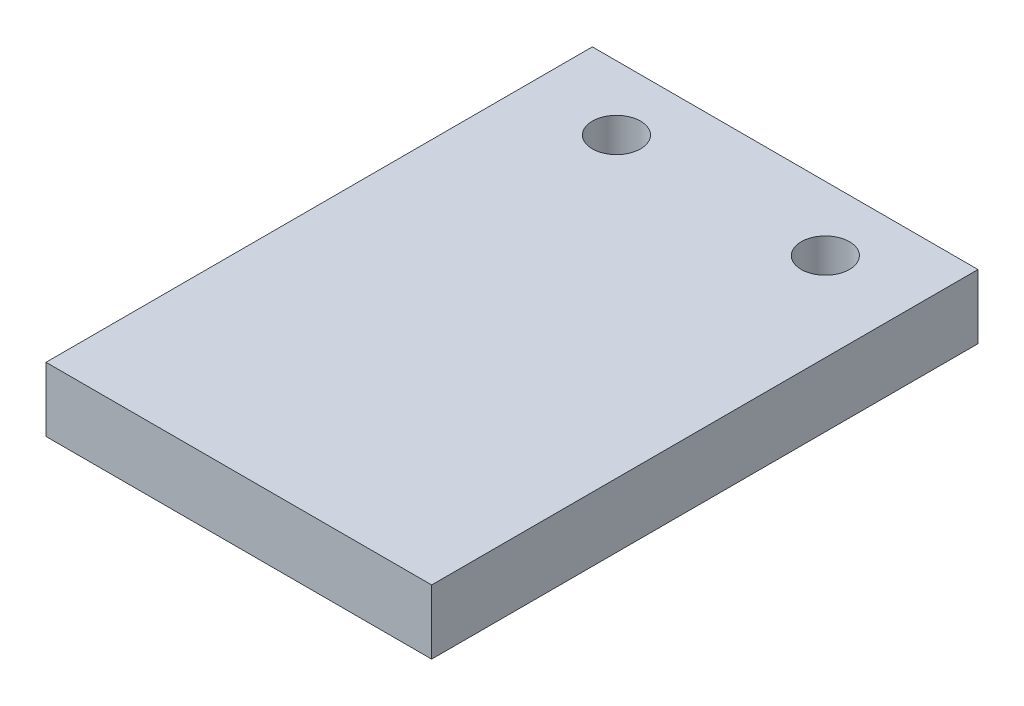
ISO-10303-21;
HEADER;
FILE_DESCRIPTION(('STEP AP214'),'2;1');
FILE_NAME('part.step','',(''),(''),'','','');
FILE_SCHEMA(('AUTOMOTIVE_DESIGN { 1 0 10303 214 1 1 1 1 }'));
ENDSEC;
DATA;
#1=APPLICATION_CONTEXT('core data for automotive mechanical design processes');
#2=APPLICATION_PROTOCOL_DEFINITION('international standard','automotive_design',2000,#1);
#3=PRODUCT_CONTEXT('',#1,'mechanical');
#4=PRODUCT('Part','Part','',(#3));
#5=PRODUCT_RELATED_PRODUCT_CATEGORY('part','',(#4));
#6=PRODUCT_DEFINITION_FORMATION('','',#4);
#7=PRODUCT_DEFINITION_CONTEXT('part definition',#1,'design');
#8=PRODUCT_DEFINITION('design','',#6,#7);
#9=PRODUCT_DEFINITION_SHAPE('','',#8);
#10=(LENGTH_UNIT() NAMED_UNIT(*) SI_UNIT(.MILLI.,.METRE.));
#11=(NAMED_UNIT(*) PLANE_ANGLE_UNIT() SI_UNIT($,.RADIAN.));
#12=(NAMED_UNIT(*) SI_UNIT($,.STERADIAN.) SOLID_ANGLE_UNIT());
#13=UNCERTAINTY_MEASURE_WITH_UNIT(LENGTH_MEASURE(1.E-05),#10,'distance_accuracy_value','');
#14=(GEOMETRIC_REPRESENTATION_CONTEXT(3) GLOBAL_UNCERTAINTY_ASSIGNED_CONTEXT((#13)) GLOBAL_UNIT_ASSIGNED_CONTEXT((#10,
#11,#12)) REPRESENTATION_CONTEXT('',''));
#15=CARTESIAN_POINT('',(0.,0.,0.));
#16=DIRECTION('',(0.,0.,1.));
#17=DIRECTION('',(1.,0.,0.));
#18=AXIS2_PLACEMENT_3D('',#15,#16,#17);
#19=CARTESIAN_POINT('',(-17.4625,12.7,-12.7));
#20=DIRECTION('',(0.,-1.,0.));
#21=DIRECTION('',(0.,0.,-1.));
#22=AXIS2_PLACEMENT_3D('',#19,#20,#21);
#23=PLANE('',#22);
#24=CARTESIAN_POINT('',(0.,12.7,0.));
#25=DIRECTION('',(0.,1.,0.));
#26=DIRECTION('',(0.,0.,1.));
#27=AXIS2_PLACEMENT_3D('',#24,#25,#26);
#28=CIRCLE('',#27,4.7625);
#29=CARTESIAN_POINT('',(0.,12.7,4.7625));
#30=VERTEX_POINT('',#29);
#31=EDGE_CURVE('E98',#30,#30,#28,.T.);
#32=ORIENTED_EDGE('',*,*,#31,.F.);
#33=EDGE_LOOP('',(#32));
#34=FACE_BOUND('',#33,.T.);
#35=DIRECTION('',(0.,0.,1.));
#36=VECTOR('',#35,1.);
#37=CARTESIAN_POINT('',(-17.4625,12.7,95.25));
#38=LINE('',#37,#36);
#39=CARTESIAN_POINT('',(-17.4625,12.7,-12.7));
#40=VERTEX_POINT('',#39);
#41=CARTESIAN_POINT('',(-17.4625,12.7,95.25));
#42=VERTEX_POINT('',#41);
#43=EDGE_CURVE('E83',#40,#42,#38,.T.);
#44=ORIENTED_EDGE('',*,*,#43,.T.);
#45=DIRECTION('',(1.,0.,0.));
#46=VECTOR('',#45,1.);
#47=CARTESIAN_POINT('',(58.7375,12.7,95.25));
#48=LINE('',#47,#46);
#49=CARTESIAN_POINT('',(58.7375,12.7,95.25));
#50=VERTEX_POINT('',#49);
#51=EDGE_CURVE('E78',#42,#50,#48,.T.);
#52=ORIENTED_EDGE('',*,*,#51,.T.);
#53=DIRECTION('',(0.,0.,-1.));
#54=VECTOR('',#53,1.);
#55=CARTESIAN_POINT('',(58.7375,12.7,-12.7));
#56=LINE('',#55,#54);
#57=CARTESIAN_POINT('',(58.7375,12.7,-12.7));
#58=VERTEX_POINT('',#57);
#59=EDGE_CURVE('E81',#50,#58,#56,.T.);
#60=ORIENTED_EDGE('',*,*,#59,.T.);
#61=DIRECTION('',(-1.,0.,0.));
#62=VECTOR('',#61,1.);
#63=CARTESIAN_POINT('',(-17.4625,12.7,-12.7));
#64=LINE('',#63,#62);
#65=EDGE_CURVE('E48',#58,#40,#64,.T.);
#66=ORIENTED_EDGE('',*,*,#65,.T.);
#67=EDGE_LOOP('',(#44,#52,#60,#66));
#68=FACE_BOUND('',#67,.T.);
#69=CARTESIAN_POINT('',(41.275,12.7,0.));
#70=DIRECTION('',(0.,1.,0.));
#71=DIRECTION('',(0.,0.,1.));
#72=AXIS2_PLACEMENT_3D('',#69,#70,#71);
#73=CIRCLE('',#72,4.7625);
#74=CARTESIAN_POINT('',(41.275,12.7,4.7625));
#75=VERTEX_POINT('',#74);
#76=EDGE_CURVE('E113',#75,#75,#73,.T.);
#77=ORIENTED_EDGE('',*,*,#76,.F.);
#78=EDGE_LOOP('',(#77));
#79=FACE_BOUND('',#78,.T.);
#80=ADVANCED_FACE('F31',(#34,#68,#79),#23,.F.);
#81=CARTESIAN_POINT('',(-17.4625,0.,-12.7));
#82=DIRECTION('',(0.,-1.,0.));
#83=DIRECTION('',(0.,0.,-1.));
#84=AXIS2_PLACEMENT_3D('',#81,#82,#83);
#85=PLANE('',#84);
#86=CARTESIAN_POINT('',(0.,0.,0.));
#87=DIRECTION('',(0.,1.,0.));
#88=DIRECTION('',(0.,0.,1.));
#89=AXIS2_PLACEMENT_3D('',#86,#87,#88);
#90=CIRCLE('',#89,4.7625);
#91=CARTESIAN_POINT('',(0.,0.,4.7625));
#92=VERTEX_POINT('',#91);
#93=EDGE_CURVE('E110',#92,#92,#90,.T.);
#94=ORIENTED_EDGE('',*,*,#93,.T.);
#95=EDGE_LOOP('',(#94));
#96=FACE_BOUND('',#95,.T.);
#97=DIRECTION('',(0.,0.,1.));
#98=VECTOR('',#97,1.);
#99=CARTESIAN_POINT('',(-17.4625,0.,95.25));
#100=LINE('',#99,#98);
#101=CARTESIAN_POINT('',(-17.4625,0.,-12.7));
#102=VERTEX_POINT('',#101);
#103=CARTESIAN_POINT('',(-17.4625,0.,95.25));
#104=VERTEX_POINT('',#103);
#105=EDGE_CURVE('E95',#102,#104,#100,.T.);
#106=ORIENTED_EDGE('',*,*,#105,.F.);
#107=DIRECTION('',(-1.,0.,0.));
#108=VECTOR('',#107,1.);
#109=CARTESIAN_POINT('',(-17.4625,0.,-12.7));
#110=LINE('',#109,#108);
#111=CARTESIAN_POINT('',(58.7375,0.,-12.7));
#112=VERTEX_POINT('',#111);
#113=EDGE_CURVE('E71',#112,#102,#110,.T.);
#114=ORIENTED_EDGE('',*,*,#113,.F.);
#115=DIRECTION('',(0.,0.,-1.));
#116=VECTOR('',#115,1.);
#117=CARTESIAN_POINT('',(58.7375,0.,-12.7));
#118=LINE('',#117,#116);
#119=CARTESIAN_POINT('',(58.7375,0.,95.25));
#120=VERTEX_POINT('',#119);
#121=EDGE_CURVE('E65',#120,#112,#118,.T.);
#122=ORIENTED_EDGE('',*,*,#121,.F.);
#123=DIRECTION('',(1.,0.,0.));
#124=VECTOR('',#123,1.);
#125=CARTESIAN_POINT('',(58.7375,0.,95.25));
#126=LINE('',#125,#124);
#127=EDGE_CURVE('E87',#104,#120,#126,.T.);
#128=ORIENTED_EDGE('',*,*,#127,.F.);
#129=EDGE_LOOP('',(#106,#114,#122,#128));
#130=FACE_BOUND('',#129,.T.);
#131=CARTESIAN_POINT('',(41.275,0.,0.));
#132=DIRECTION('',(0.,1.,0.));
#133=DIRECTION('',(0.,0.,1.));
#134=AXIS2_PLACEMENT_3D('',#131,#132,#133);
#135=CIRCLE('',#134,4.7625);
#136=CARTESIAN_POINT('',(41.275,0.,4.7625));
#137=VERTEX_POINT('',#136);
#138=EDGE_CURVE('E116',#137,#137,#135,.T.);
#139=ORIENTED_EDGE('',*,*,#138,.T.);
#140=EDGE_LOOP('',(#139));
#141=FACE_BOUND('',#140,.T.);
#142=ADVANCED_FACE('F106',(#96,#130,#141),#85,.T.);
#143=CARTESIAN_POINT('',(-17.4625,12.7,95.25));
#144=DIRECTION('',(1.,0.,0.));
#145=DIRECTION('',(0.,0.,-1.));
#146=AXIS2_PLACEMENT_3D('',#143,#144,#145);
#147=PLANE('',#146);
#148=ORIENTED_EDGE('',*,*,#105,.T.);
#149=DIRECTION('',(0.,-1.,0.));
#150=VECTOR('',#149,1.);
#151=CARTESIAN_POINT('',(-17.4625,12.7,95.25));
#152=LINE('',#151,#150);
#153=EDGE_CURVE('E11',#42,#104,#152,.T.);
#154=ORIENTED_EDGE('',*,*,#153,.F.);
#155=ORIENTED_EDGE('',*,*,#43,.F.);
#156=DIRECTION('',(0.,-1.,0.));
#157=VECTOR('',#156,1.);
#158=CARTESIAN_POINT('',(-17.4625,12.7,-12.7));
#159=LINE('',#158,#157);
#160=EDGE_CURVE('E91',#40,#102,#159,.T.);
#161=ORIENTED_EDGE('',*,*,#160,.T.);
#162=EDGE_LOOP('',(#148,#154,#155,#161));
#163=FACE_BOUND('',#162,.T.);
#164=ADVANCED_FACE('F33',(#163),#147,.F.);
#165=CARTESIAN_POINT('',(58.7375,12.7,95.25));
#166=DIRECTION('',(0.,0.,-1.));
#167=DIRECTION('',(-1.,0.,0.));
#168=AXIS2_PLACEMENT_3D('',#165,#166,#167);
#169=PLANE('',#168);
#170=ORIENTED_EDGE('',*,*,#127,.T.);
#171=DIRECTION('',(0.,-1.,0.));
#172=VECTOR('',#171,1.);
#173=CARTESIAN_POINT('',(58.7375,12.7,95.25));
#174=LINE('',#173,#172);
#175=EDGE_CURVE('E40',#50,#120,#174,.T.);
#176=ORIENTED_EDGE('',*,*,#175,.F.);
#177=ORIENTED_EDGE('',*,*,#51,.F.);
#178=ORIENTED_EDGE('',*,*,#153,.T.);
#179=EDGE_LOOP('',(#170,#176,#177,#178));
#180=FACE_BOUND('',#179,.T.);
#181=ADVANCED_FACE('F86',(#180),#169,.F.);
#182=CARTESIAN_POINT('',(58.7375,12.7,-12.7));
#183=DIRECTION('',(-1.,0.,0.));
#184=DIRECTION('',(0.,0.,1.));
#185=AXIS2_PLACEMENT_3D('',#182,#183,#184);
#186=PLANE('',#185);
#187=ORIENTED_EDGE('',*,*,#121,.T.);
#188=DIRECTION('',(0.,-1.,0.));
#189=VECTOR('',#188,1.);
#190=CARTESIAN_POINT('',(58.7375,12.7,-12.7));
#191=LINE('',#190,#189);
#192=EDGE_CURVE('E88',#58,#112,#191,.T.);
#193=ORIENTED_EDGE('',*,*,#192,.F.);
#194=ORIENTED_EDGE('',*,*,#59,.F.);
#195=ORIENTED_EDGE('',*,*,#175,.T.);
#196=EDGE_LOOP('',(#187,#193,#194,#195));
#197=FACE_BOUND('',#196,.T.);
#198=ADVANCED_FACE('F89',(#197),#186,.F.);
#199=CARTESIAN_POINT('',(-17.4625,12.7,-12.7));
#200=DIRECTION('',(0.,0.,1.));
#201=DIRECTION('',(1.,0.,0.));
#202=AXIS2_PLACEMENT_3D('',#199,#200,#201);
#203=PLANE('',#202);
#204=ORIENTED_EDGE('',*,*,#113,.T.);
#205=ORIENTED_EDGE('',*,*,#160,.F.);
#206=ORIENTED_EDGE('',*,*,#65,.F.);
#207=ORIENTED_EDGE('',*,*,#192,.T.);
#208=EDGE_LOOP('',(#204,#205,#206,#207));
#209=FACE_BOUND('',#208,.T.);
#210=ADVANCED_FACE('F103',(#209),#203,.F.);
#211=CARTESIAN_POINT('',(0.,12.7,0.));
#212=DIRECTION('',(0.,-1.,0.));
#213=DIRECTION('',(0.,0.,-1.));
#214=AXIS2_PLACEMENT_3D('',#211,#212,#213);
#215=CYLINDRICAL_SURFACE('',#214,4.7625);
#216=ORIENTED_EDGE('',*,*,#31,.T.);
#217=EDGE_LOOP('',(#216));
#218=FACE_BOUND('',#217,.T.);
#219=ORIENTED_EDGE('',*,*,#93,.F.);
#220=EDGE_LOOP('',(#219));
#221=FACE_BOUND('',#220,.T.);
#222=ADVANCED_FACE('F134',(#218,#221),#215,.F.);
#223=CARTESIAN_POINT('',(41.275,12.7,0.));
#224=DIRECTION('',(0.,-1.,0.));
#225=DIRECTION('',(0.,0.,-1.));
#226=AXIS2_PLACEMENT_3D('',#223,#224,#225);
#227=CYLINDRICAL_SURFACE('',#226,4.7625);
#228=ORIENTED_EDGE('',*,*,#76,.T.);
#229=EDGE_LOOP('',(#228));
#230=FACE_BOUND('',#229,.T.);
#231=ORIENTED_EDGE('',*,*,#138,.F.);
#232=EDGE_LOOP('',(#231));
#233=FACE_BOUND('',#232,.T.);
#234=ADVANCED_FACE('F122',(#230,#233),#227,.F.);
#235=CLOSED_SHELL('',(#80,#142,#164,#181,#198,#210,#222,#234));
#236=MANIFOLD_SOLID_BREP('B2',#235);
#237=ADVANCED_BREP_SHAPE_REPRESENTATION('',(#18,#236),#14);
#238=SHAPE_DEFINITION_REPRESENTATION(#9,#237);
ENDSEC;
END-ISO-10303-21;
